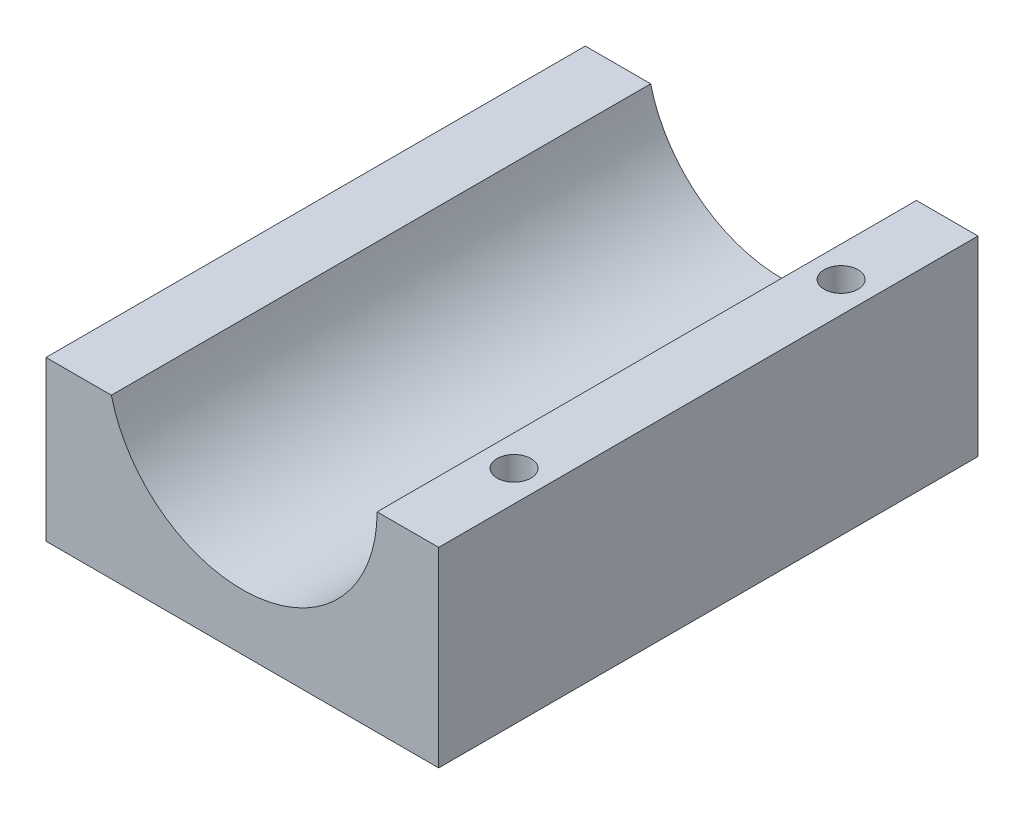
ISO-10303-21;
HEADER;
FILE_DESCRIPTION(('STEP AP214'),'2;1');
FILE_NAME('part.step','',(''),(''),'','','');
FILE_SCHEMA(('AUTOMOTIVE_DESIGN { 1 0 10303 214 1 1 1 1 }'));
ENDSEC;
DATA;
#1=APPLICATION_CONTEXT('core data for automotive mechanical design processes');
#2=APPLICATION_PROTOCOL_DEFINITION('international standard','automotive_design',2000,#1);
#3=PRODUCT_CONTEXT('',#1,'mechanical');
#4=PRODUCT('Part','Part','',(#3));
#5=PRODUCT_RELATED_PRODUCT_CATEGORY('part','',(#4));
#6=PRODUCT_DEFINITION_FORMATION('','',#4);
#7=PRODUCT_DEFINITION_CONTEXT('part definition',#1,'design');
#8=PRODUCT_DEFINITION('design','',#6,#7);
#9=PRODUCT_DEFINITION_SHAPE('','',#8);
#10=(LENGTH_UNIT() NAMED_UNIT(*) SI_UNIT(.MILLI.,.METRE.));
#11=(NAMED_UNIT(*) PLANE_ANGLE_UNIT() SI_UNIT($,.RADIAN.));
#12=(NAMED_UNIT(*) SI_UNIT($,.STERADIAN.) SOLID_ANGLE_UNIT());
#13=UNCERTAINTY_MEASURE_WITH_UNIT(LENGTH_MEASURE(1.E-05),#10,'distance_accuracy_value','');
#14=(GEOMETRIC_REPRESENTATION_CONTEXT(3) GLOBAL_UNCERTAINTY_ASSIGNED_CONTEXT((#13)) GLOBAL_UNIT_ASSIGNED_CONTEXT((#10,
#11,#12)) REPRESENTATION_CONTEXT('',''));
#15=CARTESIAN_POINT('',(0.,0.,0.));
#16=DIRECTION('',(0.,0.,1.));
#17=DIRECTION('',(1.,0.,0.));
#18=AXIS2_PLACEMENT_3D('',#15,#16,#17);
#19=CARTESIAN_POINT('',(0.,9.,0.));
#20=DIRECTION('',(1.,0.,0.));
#21=DIRECTION('',(0.,0.,-1.));
#22=AXIS2_PLACEMENT_3D('',#19,#20,#21);
#23=PLANE('',#22);
#24=DIRECTION('',(0.,0.,1.));
#25=VECTOR('',#24,1.);
#26=CARTESIAN_POINT('',(0.,7.5,-66.2778912014065));
#27=LINE('',#26,#25);
#28=CARTESIAN_POINT('',(0.,7.5,-25.41));
#29=VERTEX_POINT('',#28);
#30=CARTESIAN_POINT('',(0.,7.5,0.));
#31=VERTEX_POINT('',#30);
#32=EDGE_CURVE('E88',#29,#31,#27,.T.);
#33=ORIENTED_EDGE('',*,*,#32,.F.);
#34=DIRECTION('',(0.,-1.,0.));
#35=VECTOR('',#34,1.);
#36=CARTESIAN_POINT('',(0.,9.,-25.41));
#37=LINE('',#36,#35);
#38=CARTESIAN_POINT('',(0.,0.,-25.41));
#39=VERTEX_POINT('',#38);
#40=EDGE_CURVE('E82',#29,#39,#37,.T.);
#41=ORIENTED_EDGE('',*,*,#40,.T.);
#42=DIRECTION('',(0.,0.,1.));
#43=VECTOR('',#42,1.);
#44=CARTESIAN_POINT('',(0.,0.,0.));
#45=LINE('',#44,#43);
#46=CARTESIAN_POINT('',(0.,0.,0.));
#47=VERTEX_POINT('',#46);
#48=EDGE_CURVE('E86',#39,#47,#45,.T.);
#49=ORIENTED_EDGE('',*,*,#48,.T.);
#50=DIRECTION('',(0.,-1.,0.));
#51=VECTOR('',#50,1.);
#52=CARTESIAN_POINT('',(0.,9.,0.));
#53=LINE('',#52,#51);
#54=EDGE_CURVE('E47',#31,#47,#53,.T.);
#55=ORIENTED_EDGE('',*,*,#54,.F.);
#56=EDGE_LOOP('',(#33,#41,#49,#55));
#57=FACE_BOUND('',#56,.T.);
#58=ADVANCED_FACE('F39',(#57),#23,.F.);
#59=CARTESIAN_POINT('',(0.,9.,-25.41));
#60=DIRECTION('',(0.,0.,1.));
#61=DIRECTION('',(1.,0.,0.));
#62=AXIS2_PLACEMENT_3D('',#59,#60,#61);
#63=PLANE('',#62);
#64=DIRECTION('',(-1.,0.,0.));
#65=VECTOR('',#64,1.);
#66=CARTESIAN_POINT('',(0.,7.5,-25.41));
#67=LINE('',#66,#65);
#68=CARTESIAN_POINT('',(3.07970827269893,7.5,-25.41));
#69=VERTEX_POINT('',#68);
#70=EDGE_CURVE('E160',#69,#29,#67,.T.);
#71=ORIENTED_EDGE('',*,*,#70,.F.);
#72=CARTESIAN_POINT('',(9.25,9.,-25.41));
#73=DIRECTION('',(0.,0.,1.));
#74=DIRECTION('',(1.,0.,0.));
#75=AXIS2_PLACEMENT_3D('',#72,#73,#74);
#76=CIRCLE('',#75,6.35);
#77=CARTESIAN_POINT('',(15.6,9.,-25.41));
#78=VERTEX_POINT('',#77);
#79=EDGE_CURVE('E116',#69,#78,#76,.T.);
#80=ORIENTED_EDGE('',*,*,#79,.T.);
#81=DIRECTION('',(-1.,0.,0.));
#82=VECTOR('',#81,1.);
#83=CARTESIAN_POINT('',(0.,9.,-25.41));
#84=LINE('',#83,#82);
#85=CARTESIAN_POINT('',(18.5,9.,-25.41));
#86=VERTEX_POINT('',#85);
#87=EDGE_CURVE('E93',#86,#78,#84,.T.);
#88=ORIENTED_EDGE('',*,*,#87,.F.);
#89=DIRECTION('',(0.,-1.,0.));
#90=VECTOR('',#89,1.);
#91=CARTESIAN_POINT('',(18.5,9.,-25.41));
#92=LINE('',#91,#90);
#93=CARTESIAN_POINT('',(18.5,0.,-25.41));
#94=VERTEX_POINT('',#93);
#95=EDGE_CURVE('E92',#86,#94,#92,.T.);
#96=ORIENTED_EDGE('',*,*,#95,.T.);
#97=DIRECTION('',(-1.,0.,0.));
#98=VECTOR('',#97,1.);
#99=CARTESIAN_POINT('',(0.,0.,-25.41));
#100=LINE('',#99,#98);
#101=EDGE_CURVE('E97',#94,#39,#100,.T.);
#102=ORIENTED_EDGE('',*,*,#101,.T.);
#103=ORIENTED_EDGE('',*,*,#40,.F.);
#104=EDGE_LOOP('',(#71,#80,#88,#96,#102,#103));
#105=FACE_BOUND('',#104,.T.);
#106=ADVANCED_FACE('F98',(#105),#63,.F.);
#107=CARTESIAN_POINT('',(0.,9.,0.));
#108=DIRECTION('',(0.,-1.,0.));
#109=DIRECTION('',(0.,0.,-1.));
#110=AXIS2_PLACEMENT_3D('',#107,#108,#109);
#111=PLANE('',#110);
#112=CARTESIAN_POINT('',(17.05,9.,-20.41));
#113=DIRECTION('',(0.,1.,0.));
#114=DIRECTION('',(0.,0.,1.));
#115=AXIS2_PLACEMENT_3D('',#112,#113,#114);
#116=CIRCLE('',#115,0.799999999999999);
#117=CARTESIAN_POINT('',(17.05,9.,-19.61));
#118=VERTEX_POINT('',#117);
#119=EDGE_CURVE('E174',#118,#118,#116,.T.);
#120=ORIENTED_EDGE('',*,*,#119,.F.);
#121=EDGE_LOOP('',(#120));
#122=FACE_BOUND('',#121,.T.);
#123=CARTESIAN_POINT('',(17.05,9.,-5.));
#124=DIRECTION('',(0.,1.,0.));
#125=DIRECTION('',(0.,0.,1.));
#126=AXIS2_PLACEMENT_3D('',#123,#124,#125);
#127=CIRCLE('',#126,0.799999999999999);
#128=CARTESIAN_POINT('',(17.05,9.,-4.2));
#129=VERTEX_POINT('',#128);
#130=EDGE_CURVE('E166',#129,#129,#127,.T.);
#131=ORIENTED_EDGE('',*,*,#130,.F.);
#132=EDGE_LOOP('',(#131));
#133=FACE_BOUND('',#132,.T.);
#134=ORIENTED_EDGE('',*,*,#87,.T.);
#135=DIRECTION('',(0.,0.,1.));
#136=VECTOR('',#135,1.);
#137=CARTESIAN_POINT('',(15.6,9.,-25.41));
#138=LINE('',#137,#136);
#139=CARTESIAN_POINT('',(15.6,9.,0.));
#140=VERTEX_POINT('',#139);
#141=EDGE_CURVE('E110',#78,#140,#138,.T.);
#142=ORIENTED_EDGE('',*,*,#141,.T.);
#143=DIRECTION('',(1.,0.,0.));
#144=VECTOR('',#143,1.);
#145=CARTESIAN_POINT('',(0.,9.,0.));
#146=LINE('',#145,#144);
#147=CARTESIAN_POINT('',(18.5,9.,0.));
#148=VERTEX_POINT('',#147);
#149=EDGE_CURVE('E103',#140,#148,#146,.T.);
#150=ORIENTED_EDGE('',*,*,#149,.T.);
#151=DIRECTION('',(0.,0.,-1.));
#152=VECTOR('',#151,1.);
#153=CARTESIAN_POINT('',(18.5,9.,0.));
#154=LINE('',#153,#152);
#155=EDGE_CURVE('E62',#148,#86,#154,.T.);
#156=ORIENTED_EDGE('',*,*,#155,.T.);
#157=EDGE_LOOP('',(#134,#142,#150,#156));
#158=FACE_BOUND('',#157,.T.);
#159=ADVANCED_FACE('F151',(#122,#133,#158),#111,.F.);
#160=CARTESIAN_POINT('',(0.,9.,0.));
#161=DIRECTION('',(0.,0.,-1.));
#162=DIRECTION('',(-1.,0.,0.));
#163=AXIS2_PLACEMENT_3D('',#160,#161,#162);
#164=PLANE('',#163);
#165=CARTESIAN_POINT('',(9.25,9.,0.));
#166=DIRECTION('',(0.,0.,1.));
#167=DIRECTION('',(1.,0.,0.));
#168=AXIS2_PLACEMENT_3D('',#165,#166,#167);
#169=CIRCLE('',#168,6.35);
#170=CARTESIAN_POINT('',(3.07970827269893,7.5,0.));
#171=VERTEX_POINT('',#170);
#172=EDGE_CURVE('E145',#171,#140,#169,.T.);
#173=ORIENTED_EDGE('',*,*,#172,.F.);
#174=DIRECTION('',(-1.,0.,0.));
#175=VECTOR('',#174,1.);
#176=CARTESIAN_POINT('',(0.,7.5,0.));
#177=LINE('',#176,#175);
#178=EDGE_CURVE('E54',#171,#31,#177,.T.);
#179=ORIENTED_EDGE('',*,*,#178,.T.);
#180=ORIENTED_EDGE('',*,*,#54,.T.);
#181=DIRECTION('',(1.,0.,0.));
#182=VECTOR('',#181,1.);
#183=CARTESIAN_POINT('',(0.,0.,0.));
#184=LINE('',#183,#182);
#185=CARTESIAN_POINT('',(18.5,0.,0.));
#186=VERTEX_POINT('',#185);
#187=EDGE_CURVE('E108',#47,#186,#184,.T.);
#188=ORIENTED_EDGE('',*,*,#187,.T.);
#189=DIRECTION('',(0.,-1.,0.));
#190=VECTOR('',#189,1.);
#191=CARTESIAN_POINT('',(18.5,9.,0.));
#192=LINE('',#191,#190);
#193=EDGE_CURVE('E125',#148,#186,#192,.T.);
#194=ORIENTED_EDGE('',*,*,#193,.F.);
#195=ORIENTED_EDGE('',*,*,#149,.F.);
#196=EDGE_LOOP('',(#173,#179,#180,#188,#194,#195));
#197=FACE_BOUND('',#196,.T.);
#198=ADVANCED_FACE('F131',(#197),#164,.F.);
#199=CARTESIAN_POINT('',(18.5,9.,0.));
#200=DIRECTION('',(-1.,0.,0.));
#201=DIRECTION('',(0.,0.,1.));
#202=AXIS2_PLACEMENT_3D('',#199,#200,#201);
#203=PLANE('',#202);
#204=DIRECTION('',(0.,0.,-1.));
#205=VECTOR('',#204,1.);
#206=CARTESIAN_POINT('',(18.5,0.,0.));
#207=LINE('',#206,#205);
#208=EDGE_CURVE('E104',#186,#94,#207,.T.);
#209=ORIENTED_EDGE('',*,*,#208,.T.);
#210=ORIENTED_EDGE('',*,*,#95,.F.);
#211=ORIENTED_EDGE('',*,*,#155,.F.);
#212=ORIENTED_EDGE('',*,*,#193,.T.);
#213=EDGE_LOOP('',(#209,#210,#211,#212));
#214=FACE_BOUND('',#213,.T.);
#215=ADVANCED_FACE('F214',(#214),#203,.F.);
#216=CARTESIAN_POINT('',(0.,0.,0.));
#217=DIRECTION('',(0.,-1.,0.));
#218=DIRECTION('',(0.,0.,-1.));
#219=AXIS2_PLACEMENT_3D('',#216,#217,#218);
#220=PLANE('',#219);
#221=CARTESIAN_POINT('',(17.05,0.,-20.41));
#222=DIRECTION('',(0.,1.,0.));
#223=DIRECTION('',(0.,0.,1.));
#224=AXIS2_PLACEMENT_3D('',#221,#222,#223);
#225=CIRCLE('',#224,0.799999999999999);
#226=CARTESIAN_POINT('',(17.05,0.,-19.61));
#227=VERTEX_POINT('',#226);
#228=EDGE_CURVE('E163',#227,#227,#225,.T.);
#229=ORIENTED_EDGE('',*,*,#228,.T.);
#230=EDGE_LOOP('',(#229));
#231=FACE_BOUND('',#230,.T.);
#232=CARTESIAN_POINT('',(17.05,0.,-5.));
#233=DIRECTION('',(0.,1.,0.));
#234=DIRECTION('',(0.,0.,1.));
#235=AXIS2_PLACEMENT_3D('',#232,#233,#234);
#236=CIRCLE('',#235,0.799999999999999);
#237=CARTESIAN_POINT('',(17.05,0.,-4.2));
#238=VERTEX_POINT('',#237);
#239=EDGE_CURVE('E170',#238,#238,#236,.T.);
#240=ORIENTED_EDGE('',*,*,#239,.T.);
#241=EDGE_LOOP('',(#240));
#242=FACE_BOUND('',#241,.T.);
#243=ORIENTED_EDGE('',*,*,#48,.F.);
#244=ORIENTED_EDGE('',*,*,#101,.F.);
#245=ORIENTED_EDGE('',*,*,#208,.F.);
#246=ORIENTED_EDGE('',*,*,#187,.F.);
#247=EDGE_LOOP('',(#243,#244,#245,#246));
#248=FACE_BOUND('',#247,.T.);
#249=ADVANCED_FACE('F107',(#231,#242,#248),#220,.T.);
#250=CARTESIAN_POINT('',(9.25,9.,-25.41));
#251=DIRECTION('',(0.,0.,1.));
#252=DIRECTION('',(1.,0.,0.));
#253=AXIS2_PLACEMENT_3D('',#250,#251,#252);
#254=CYLINDRICAL_SURFACE('',#253,6.35);
#255=ORIENTED_EDGE('',*,*,#79,.F.);
#256=DIRECTION('',(0.,0.,1.));
#257=VECTOR('',#256,1.);
#258=CARTESIAN_POINT('',(3.07970827269893,7.5,-25.41));
#259=LINE('',#258,#257);
#260=EDGE_CURVE('E11',#69,#171,#259,.T.);
#261=ORIENTED_EDGE('',*,*,#260,.T.);
#262=ORIENTED_EDGE('',*,*,#172,.T.);
#263=ORIENTED_EDGE('',*,*,#141,.F.);
#264=EDGE_LOOP('',(#255,#261,#262,#263));
#265=FACE_BOUND('',#264,.T.);
#266=ADVANCED_FACE('F147',(#265),#254,.F.);
#267=CARTESIAN_POINT('',(0.,7.5,-66.2778912014065));
#268=DIRECTION('',(0.,-1.,0.));
#269=DIRECTION('',(0.,0.,-1.));
#270=AXIS2_PLACEMENT_3D('',#267,#268,#269);
#271=PLANE('',#270);
#272=ORIENTED_EDGE('',*,*,#260,.F.);
#273=ORIENTED_EDGE('',*,*,#70,.T.);
#274=ORIENTED_EDGE('',*,*,#32,.T.);
#275=ORIENTED_EDGE('',*,*,#178,.F.);
#276=EDGE_LOOP('',(#272,#273,#274,#275));
#277=FACE_BOUND('',#276,.T.);
#278=ADVANCED_FACE('F197',(#277),#271,.F.);
#279=CARTESIAN_POINT('',(17.05,0.,-5.));
#280=DIRECTION('',(0.,1.,0.));
#281=DIRECTION('',(0.,0.,1.));
#282=AXIS2_PLACEMENT_3D('',#279,#280,#281);
#283=CYLINDRICAL_SURFACE('',#282,0.799999999999999);
#284=ORIENTED_EDGE('',*,*,#239,.F.);
#285=EDGE_LOOP('',(#284));
#286=FACE_BOUND('',#285,.T.);
#287=ORIENTED_EDGE('',*,*,#130,.T.);
#288=EDGE_LOOP('',(#287));
#289=FACE_BOUND('',#288,.T.);
#290=ADVANCED_FACE('F187',(#286,#289),#283,.F.);
#291=CARTESIAN_POINT('',(17.05,0.,-20.41));
#292=DIRECTION('',(0.,1.,0.));
#293=DIRECTION('',(0.,0.,1.));
#294=AXIS2_PLACEMENT_3D('',#291,#292,#293);
#295=CYLINDRICAL_SURFACE('',#294,0.799999999999999);
#296=ORIENTED_EDGE('',*,*,#228,.F.);
#297=EDGE_LOOP('',(#296));
#298=FACE_BOUND('',#297,.T.);
#299=ORIENTED_EDGE('',*,*,#119,.T.);
#300=EDGE_LOOP('',(#299));
#301=FACE_BOUND('',#300,.T.);
#302=ADVANCED_FACE('F184',(#298,#301),#295,.F.);
#303=CLOSED_SHELL('',(#58,#106,#159,#198,#215,#249,#266,#278,#290,#302));
#304=MANIFOLD_SOLID_BREP('B2',#303);
#305=ADVANCED_BREP_SHAPE_REPRESENTATION('',(#18,#304),#14);
#306=SHAPE_DEFINITION_REPRESENTATION(#9,#305);
ENDSEC;
END-ISO-10303-21;
